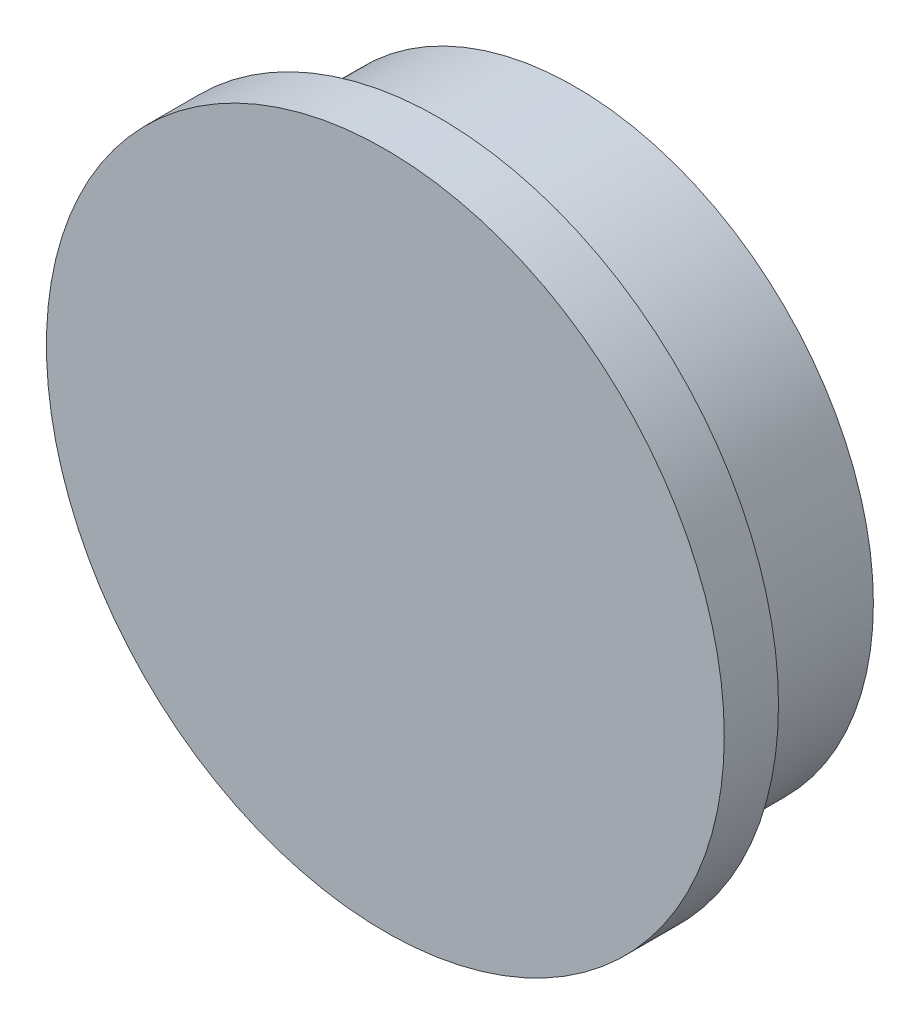
ISO-10303-21;
HEADER;
FILE_DESCRIPTION(('STEP AP214'),'2;1');
FILE_NAME('part.step','',(''),(''),'','','');
FILE_SCHEMA(('AUTOMOTIVE_DESIGN { 1 0 10303 214 1 1 1 1 }'));
ENDSEC;
DATA;
#1=APPLICATION_CONTEXT('core data for automotive mechanical design processes');
#2=APPLICATION_PROTOCOL_DEFINITION('international standard','automotive_design',2000,#1);
#3=PRODUCT_CONTEXT('',#1,'mechanical');
#4=PRODUCT('Part','Part','',(#3));
#5=PRODUCT_RELATED_PRODUCT_CATEGORY('part','',(#4));
#6=PRODUCT_DEFINITION_FORMATION('','',#4);
#7=PRODUCT_DEFINITION_CONTEXT('part definition',#1,'design');
#8=PRODUCT_DEFINITION('design','',#6,#7);
#9=PRODUCT_DEFINITION_SHAPE('','',#8);
#10=(LENGTH_UNIT() NAMED_UNIT(*) SI_UNIT(.MILLI.,.METRE.));
#11=(NAMED_UNIT(*) PLANE_ANGLE_UNIT() SI_UNIT($,.RADIAN.));
#12=(NAMED_UNIT(*) SI_UNIT($,.STERADIAN.) SOLID_ANGLE_UNIT());
#13=UNCERTAINTY_MEASURE_WITH_UNIT(LENGTH_MEASURE(1.E-05),#10,'distance_accuracy_value','');
#14=(GEOMETRIC_REPRESENTATION_CONTEXT(3) GLOBAL_UNCERTAINTY_ASSIGNED_CONTEXT((#13)) GLOBAL_UNIT_ASSIGNED_CONTEXT((#10,
#11,#12)) REPRESENTATION_CONTEXT('',''));
#15=CARTESIAN_POINT('',(0.,0.,0.));
#16=DIRECTION('',(0.,0.,1.));
#17=DIRECTION('',(1.,0.,0.));
#18=AXIS2_PLACEMENT_3D('',#15,#16,#17);
#19=CARTESIAN_POINT('',(35.4584,-19.2887699682416,-2.54));
#20=DIRECTION('',(0.,0.,1.));
#21=DIRECTION('',(1.,0.,0.));
#22=AXIS2_PLACEMENT_3D('',#19,#20,#21);
#23=CYLINDRICAL_SURFACE('',#22,5.588);
#24=CARTESIAN_POINT('',(35.4584,-19.2887699682416,-2.54));
#25=DIRECTION('',(0.,0.,1.));
#26=DIRECTION('',(1.,0.,0.));
#27=AXIS2_PLACEMENT_3D('',#24,#25,#26);
#28=CIRCLE('',#27,5.588);
#29=CARTESIAN_POINT('',(41.0464,-19.2887699682416,-2.54));
#30=VERTEX_POINT('',#29);
#31=EDGE_CURVE('E10',#30,#30,#28,.T.);
#32=ORIENTED_EDGE('',*,*,#31,.T.);
#33=EDGE_LOOP('',(#32));
#34=FACE_BOUND('',#33,.T.);
#35=CARTESIAN_POINT('',(35.4584,-19.2887699682416,0.));
#36=DIRECTION('',(0.,0.,1.));
#37=DIRECTION('',(1.,0.,0.));
#38=AXIS2_PLACEMENT_3D('',#35,#36,#37);
#39=CIRCLE('',#38,5.588);
#40=CARTESIAN_POINT('',(41.0464,-19.2887699682416,0.));
#41=VERTEX_POINT('',#40);
#42=EDGE_CURVE('E38',#41,#41,#39,.T.);
#43=ORIENTED_EDGE('',*,*,#42,.F.);
#44=EDGE_LOOP('',(#43));
#45=FACE_BOUND('',#44,.T.);
#46=ADVANCED_FACE('F35',(#34,#45),#23,.T.);
#47=CARTESIAN_POINT('',(35.4584,-19.2887699682416,-2.54));
#48=DIRECTION('',(0.,0.,1.));
#49=DIRECTION('',(1.,0.,0.));
#50=AXIS2_PLACEMENT_3D('',#47,#48,#49);
#51=PLANE('',#50);
#52=ORIENTED_EDGE('',*,*,#31,.F.);
#53=EDGE_LOOP('',(#52));
#54=FACE_BOUND('',#53,.T.);
#55=ADVANCED_FACE('F58',(#54),#51,.F.);
#56=CARTESIAN_POINT('',(35.4584,-19.2887699682416,1.016));
#57=DIRECTION('',(0.,0.,-1.));
#58=DIRECTION('',(-1.,0.,0.));
#59=AXIS2_PLACEMENT_3D('',#56,#57,#58);
#60=CYLINDRICAL_SURFACE('',#59,6.35);
#61=CARTESIAN_POINT('',(35.4584,-19.2887699682416,1.016));
#62=DIRECTION('',(0.,0.,1.));
#63=DIRECTION('',(1.,0.,0.));
#64=AXIS2_PLACEMENT_3D('',#61,#62,#63);
#65=CIRCLE('',#64,6.35);
#66=CARTESIAN_POINT('',(41.8084,-19.2887699682416,1.016));
#67=VERTEX_POINT('',#66);
#68=EDGE_CURVE('E45',#67,#67,#65,.T.);
#69=ORIENTED_EDGE('',*,*,#68,.F.);
#70=EDGE_LOOP('',(#69));
#71=FACE_BOUND('',#70,.T.);
#72=CARTESIAN_POINT('',(35.4584,-19.2887699682416,0.));
#73=DIRECTION('',(0.,0.,1.));
#74=DIRECTION('',(1.,0.,0.));
#75=AXIS2_PLACEMENT_3D('',#72,#73,#74);
#76=CIRCLE('',#75,6.35);
#77=CARTESIAN_POINT('',(41.8084,-19.2887699682416,0.));
#78=VERTEX_POINT('',#77);
#79=EDGE_CURVE('E47',#78,#78,#76,.T.);
#80=ORIENTED_EDGE('',*,*,#79,.T.);
#81=EDGE_LOOP('',(#80));
#82=FACE_BOUND('',#81,.T.);
#83=ADVANCED_FACE('F55',(#71,#82),#60,.T.);
#84=CARTESIAN_POINT('',(35.4584,-19.2887699682416,1.016));
#85=DIRECTION('',(0.,0.,1.));
#86=DIRECTION('',(1.,0.,0.));
#87=AXIS2_PLACEMENT_3D('',#84,#85,#86);
#88=PLANE('',#87);
#89=ORIENTED_EDGE('',*,*,#68,.T.);
#90=EDGE_LOOP('',(#89));
#91=FACE_BOUND('',#90,.T.);
#92=ADVANCED_FACE('F53',(#91),#88,.T.);
#93=CARTESIAN_POINT('',(35.4584,-19.2887699682416,0.));
#94=DIRECTION('',(0.,0.,1.));
#95=DIRECTION('',(1.,0.,0.));
#96=AXIS2_PLACEMENT_3D('',#93,#94,#95);
#97=PLANE('',#96);
#98=ORIENTED_EDGE('',*,*,#42,.T.);
#99=EDGE_LOOP('',(#98));
#100=FACE_BOUND('',#99,.T.);
#101=ORIENTED_EDGE('',*,*,#79,.F.);
#102=EDGE_LOOP('',(#101));
#103=FACE_BOUND('',#102,.T.);
#104=ADVANCED_FACE('F62',(#100,#103),#97,.F.);
#105=CLOSED_SHELL('',(#46,#55,#83,#92,#104));
#106=MANIFOLD_SOLID_BREP('B2',#105);
#107=ADVANCED_BREP_SHAPE_REPRESENTATION('',(#18,#106),#14);
#108=SHAPE_DEFINITION_REPRESENTATION(#9,#107);
ENDSEC;
END-ISO-10303-21;
